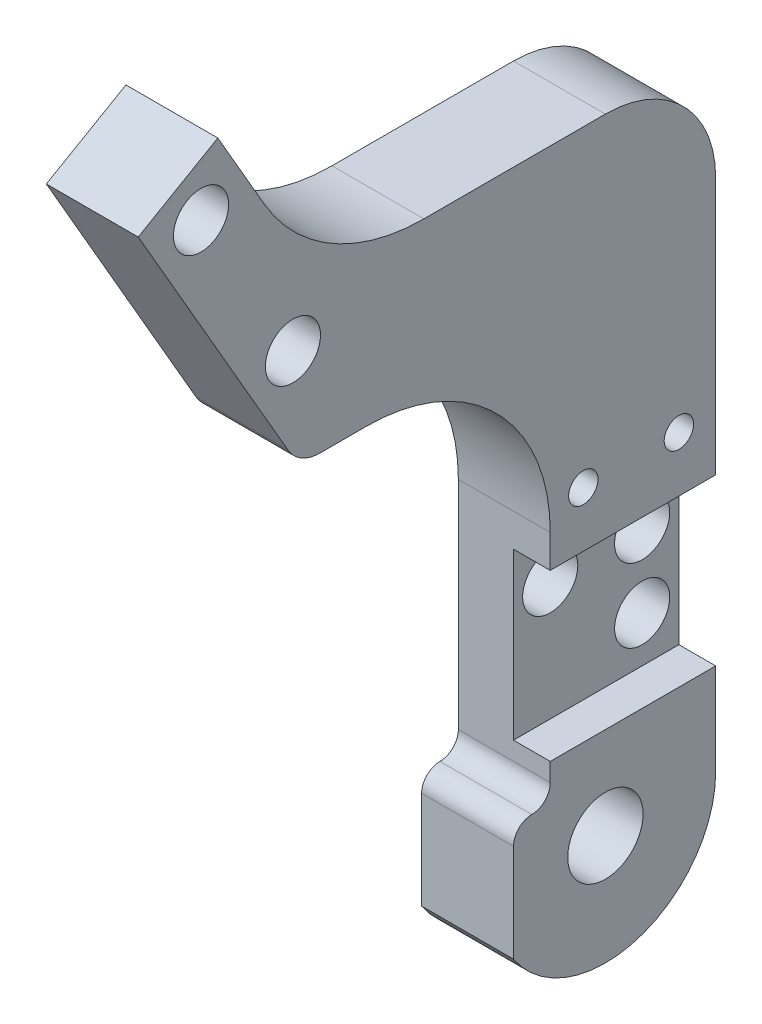
ISO-10303-21;
HEADER;
FILE_DESCRIPTION(('STEP AP214'),'2;1');
FILE_NAME('part.step','',(''),(''),'','','');
FILE_SCHEMA(('AUTOMOTIVE_DESIGN { 1 0 10303 214 1 1 1 1 }'));
ENDSEC;
DATA;
#1=APPLICATION_CONTEXT('core data for automotive mechanical design processes');
#2=APPLICATION_PROTOCOL_DEFINITION('international standard','automotive_design',2000,#1);
#3=PRODUCT_CONTEXT('',#1,'mechanical');
#4=PRODUCT('Part','Part','',(#3));
#5=PRODUCT_RELATED_PRODUCT_CATEGORY('part','',(#4));
#6=PRODUCT_DEFINITION_FORMATION('','',#4);
#7=PRODUCT_DEFINITION_CONTEXT('part definition',#1,'design');
#8=PRODUCT_DEFINITION('design','',#6,#7);
#9=PRODUCT_DEFINITION_SHAPE('','',#8);
#10=(LENGTH_UNIT() NAMED_UNIT(*) SI_UNIT(.MILLI.,.METRE.));
#11=(NAMED_UNIT(*) PLANE_ANGLE_UNIT() SI_UNIT($,.RADIAN.));
#12=(NAMED_UNIT(*) SI_UNIT($,.STERADIAN.) SOLID_ANGLE_UNIT());
#13=UNCERTAINTY_MEASURE_WITH_UNIT(LENGTH_MEASURE(1.E-05),#10,'distance_accuracy_value','');
#14=(GEOMETRIC_REPRESENTATION_CONTEXT(3) GLOBAL_UNCERTAINTY_ASSIGNED_CONTEXT((#13)) GLOBAL_UNIT_ASSIGNED_CONTEXT((#10,
#11,#12)) REPRESENTATION_CONTEXT('',''));
#15=CARTESIAN_POINT('',(0.,0.,0.));
#16=DIRECTION('',(0.,0.,1.));
#17=DIRECTION('',(1.,0.,0.));
#18=AXIS2_PLACEMENT_3D('',#15,#16,#17);
#19=CARTESIAN_POINT('',(0.,0.,0.));
#20=DIRECTION('',(-1.,0.,0.));
#21=DIRECTION('',(0.,0.,1.));
#22=AXIS2_PLACEMENT_3D('',#19,#20,#21);
#23=PLANE('',#22);
#24=CARTESIAN_POINT('',(0.,7.5,-4.));
#25=DIRECTION('',(1.,0.,0.));
#26=DIRECTION('',(0.,0.,-1.));
#27=AXIS2_PLACEMENT_3D('',#24,#25,#26);
#28=CIRCLE('',#27,1.5);
#29=CARTESIAN_POINT('',(0.,7.5,-5.5));
#30=VERTEX_POINT('',#29);
#31=EDGE_CURVE('E225',#30,#30,#28,.T.);
#32=ORIENTED_EDGE('',*,*,#31,.T.);
#33=EDGE_LOOP('',(#32));
#34=FACE_BOUND('',#33,.T.);
#35=CARTESIAN_POINT('',(0.,11.5,1.));
#36=DIRECTION('',(1.,0.,0.));
#37=DIRECTION('',(0.,0.,-1.));
#38=AXIS2_PLACEMENT_3D('',#35,#36,#37);
#39=CIRCLE('',#38,1.5);
#40=CARTESIAN_POINT('',(0.,11.5,-0.5));
#41=VERTEX_POINT('',#40);
#42=EDGE_CURVE('E231',#41,#41,#39,.T.);
#43=ORIENTED_EDGE('',*,*,#42,.T.);
#44=EDGE_LOOP('',(#43));
#45=FACE_BOUND('',#44,.T.);
#46=CARTESIAN_POINT('',(0.,40.,21.9999999999999));
#47=DIRECTION('',(1.,0.,0.));
#48=DIRECTION('',(0.,0.,-1.));
#49=AXIS2_PLACEMENT_3D('',#46,#47,#48);
#50=CIRCLE('',#49,1.5);
#51=CARTESIAN_POINT('',(0.,40.,20.4999999999999));
#52=VERTEX_POINT('',#51);
#53=EDGE_CURVE('E238',#52,#52,#50,.T.);
#54=ORIENTED_EDGE('',*,*,#53,.T.);
#55=EDGE_LOOP('',(#54));
#56=FACE_BOUND('',#55,.T.);
#57=DIRECTION('',(0.,-1.,0.));
#58=VECTOR('',#57,1.);
#59=CARTESIAN_POINT('',(0.,3.,5.));
#60=LINE('',#59,#58);
#61=CARTESIAN_POINT('',(0.,2.,5.));
#62=VERTEX_POINT('',#61);
#63=CARTESIAN_POINT('',(0.,-3.3166247903554,5.));
#64=VERTEX_POINT('',#63);
#65=EDGE_CURVE('E257',#62,#64,#60,.T.);
#66=ORIENTED_EDGE('',*,*,#65,.F.);
#67=CARTESIAN_POINT('',(0.,2.,4.));
#68=DIRECTION('',(-1.,0.,0.));
#69=DIRECTION('',(0.,0.,1.));
#70=AXIS2_PLACEMENT_3D('',#67,#68,#69);
#71=CIRCLE('',#70,1.);
#72=CARTESIAN_POINT('',(0.,3.,4.));
#73=VERTEX_POINT('',#72);
#74=EDGE_CURVE('E349',#62,#73,#71,.T.);
#75=ORIENTED_EDGE('',*,*,#74,.T.);
#76=CARTESIAN_POINT('',(0.,4.,4.));
#77=DIRECTION('',(-1.,0.,0.));
#78=DIRECTION('',(0.,0.,1.));
#79=AXIS2_PLACEMENT_3D('',#76,#77,#78);
#80=CIRCLE('',#79,1.);
#81=CARTESIAN_POINT('',(0.,4.,3.));
#82=VERTEX_POINT('',#81);
#83=EDGE_CURVE('E46',#73,#82,#80,.F.);
#84=ORIENTED_EDGE('',*,*,#83,.T.);
#85=DIRECTION('',(0.,-1.,0.));
#86=VECTOR('',#85,1.);
#87=CARTESIAN_POINT('',(0.,15.7901891737369,3.));
#88=LINE('',#87,#86);
#89=CARTESIAN_POINT('',(0.,15.7901891737369,3.));
#90=VERTEX_POINT('',#89);
#91=EDGE_CURVE('E307',#90,#82,#88,.T.);
#92=ORIENTED_EDGE('',*,*,#91,.F.);
#93=CARTESIAN_POINT('',(0.,15.7901891737369,13.));
#94=DIRECTION('',(-1.,0.,0.));
#95=DIRECTION('',(0.,0.,1.));
#96=AXIS2_PLACEMENT_3D('',#93,#94,#95);
#97=CIRCLE('',#96,10.);
#98=CARTESIAN_POINT('',(0.,25.7901891737369,13.));
#99=VERTEX_POINT('',#98);
#100=EDGE_CURVE('E305',#99,#90,#97,.T.);
#101=ORIENTED_EDGE('',*,*,#100,.F.);
#102=DIRECTION('',(0.,0.,-1.));
#103=VECTOR('',#102,1.);
#104=CARTESIAN_POINT('',(0.,25.7901891737369,15.5280127018921));
#105=LINE('',#104,#103);
#106=CARTESIAN_POINT('',(0.,25.7901891737369,15.5280127018921));
#107=VERTEX_POINT('',#106);
#108=EDGE_CURVE('E303',#107,#99,#105,.T.);
#109=ORIENTED_EDGE('',*,*,#108,.F.);
#110=CARTESIAN_POINT('',(0.,27.7901891737369,15.5280127018921));
#111=DIRECTION('',(1.,0.,0.));
#112=DIRECTION('',(0.,0.,-1.));
#113=AXIS2_PLACEMENT_3D('',#110,#111,#112);
#114=CIRCLE('',#113,2.00000000000001);
#115=CARTESIAN_POINT('',(0.,26.7901891737369,17.260063509461));
#116=VERTEX_POINT('',#115);
#117=EDGE_CURVE('E301',#116,#107,#114,.T.);
#118=ORIENTED_EDGE('',*,*,#117,.F.);
#119=DIRECTION('',(0.,-0.866025403784436,-0.500000000000004));
#120=VECTOR('',#119,1.);
#121=CARTESIAN_POINT('',(0.,40.9150635094611,25.415063509461));
#122=LINE('',#121,#120);
#123=CARTESIAN_POINT('',(0.,40.9150635094611,25.415063509461));
#124=VERTEX_POINT('',#123);
#125=EDGE_CURVE('E299',#124,#116,#122,.T.);
#126=ORIENTED_EDGE('',*,*,#125,.F.);
#127=DIRECTION('',(0.,-0.500000000000004,0.866025403784436));
#128=VECTOR('',#127,1.);
#129=CARTESIAN_POINT('',(0.,43.4150635094611,21.0849364905389));
#130=LINE('',#129,#128);
#131=CARTESIAN_POINT('',(0.,43.4150635094611,21.0849364905389));
#132=VERTEX_POINT('',#131);
#133=EDGE_CURVE('E297',#132,#124,#130,.T.);
#134=ORIENTED_EDGE('',*,*,#133,.F.);
#135=DIRECTION('',(0.,0.866025403784437,0.500000000000004));
#136=VECTOR('',#135,1.);
#137=CARTESIAN_POINT('',(0.,39.,18.5358983848621));
#138=LINE('',#137,#136);
#139=CARTESIAN_POINT('',(0.,39.,18.5358983848621));
#140=VERTEX_POINT('',#139);
#141=EDGE_CURVE('E295',#140,#132,#138,.T.);
#142=ORIENTED_EDGE('',*,*,#141,.F.);
#143=CARTESIAN_POINT('',(0.,44.,9.87564434701778));
#144=DIRECTION('',(-1.,0.,0.));
#145=DIRECTION('',(0.,0.,1.));
#146=AXIS2_PLACEMENT_3D('',#143,#144,#145);
#147=CIRCLE('',#146,10.);
#148=CARTESIAN_POINT('',(0.,34.,9.87564434701778));
#149=VERTEX_POINT('',#148);
#150=EDGE_CURVE('E293',#149,#140,#147,.T.);
#151=ORIENTED_EDGE('',*,*,#150,.F.);
#152=DIRECTION('',(0.,0.,1.));
#153=VECTOR('',#152,1.);
#154=CARTESIAN_POINT('',(0.,34.,0.));
#155=LINE('',#154,#153);
#156=CARTESIAN_POINT('',(0.,34.,0.));
#157=VERTEX_POINT('',#156);
#158=EDGE_CURVE('E291',#157,#149,#155,.T.);
#159=ORIENTED_EDGE('',*,*,#158,.F.);
#160=CARTESIAN_POINT('',(0.,28.,0.));
#161=DIRECTION('',(1.,0.,0.));
#162=DIRECTION('',(0.,0.,-1.));
#163=AXIS2_PLACEMENT_3D('',#160,#161,#162);
#164=CIRCLE('',#163,6.);
#165=CARTESIAN_POINT('',(0.,28.,-6.));
#166=VERTEX_POINT('',#165);
#167=EDGE_CURVE('E289',#166,#157,#164,.T.);
#168=ORIENTED_EDGE('',*,*,#167,.F.);
#169=DIRECTION('',(0.,1.,0.));
#170=VECTOR('',#169,1.);
#171=CARTESIAN_POINT('',(0.,0.,-6.));
#172=LINE('',#171,#170);
#173=CARTESIAN_POINT('',(0.,0.,-6.));
#174=VERTEX_POINT('',#173);
#175=EDGE_CURVE('E287',#174,#166,#172,.T.);
#176=ORIENTED_EDGE('',*,*,#175,.F.);
#177=CARTESIAN_POINT('',(0.,0.,0.));
#178=DIRECTION('',(1.,0.,0.));
#179=DIRECTION('',(0.,0.,1.));
#180=AXIS2_PLACEMENT_3D('',#177,#178,#179);
#181=CIRCLE('',#180,6.);
#182=EDGE_CURVE('E250',#64,#174,#181,.T.);
#183=ORIENTED_EDGE('',*,*,#182,.F.);
#184=EDGE_LOOP('',(#66,#75,#84,#92,#101,#109,#118,#126,#134,#142,#151,#159,#168,#176,#183));
#185=FACE_BOUND('',#184,.T.);
#186=CARTESIAN_POINT('',(0.,0.,0.));
#187=DIRECTION('',(1.,0.,0.));
#188=DIRECTION('',(0.,0.,-1.));
#189=AXIS2_PLACEMENT_3D('',#186,#187,#188);
#190=CIRCLE('',#189,2.05);
#191=CARTESIAN_POINT('',(0.,0.,-2.05));
#192=VERTEX_POINT('',#191);
#193=EDGE_CURVE('E244',#192,#192,#190,.T.);
#194=ORIENTED_EDGE('',*,*,#193,.T.);
#195=EDGE_LOOP('',(#194));
#196=FACE_BOUND('',#195,.T.);
#197=CARTESIAN_POINT('',(0.,31.3397459621556,16.9999999999999));
#198=DIRECTION('',(1.,0.,0.));
#199=DIRECTION('',(0.,0.,-1.));
#200=AXIS2_PLACEMENT_3D('',#197,#198,#199);
#201=CIRCLE('',#200,1.5);
#202=CARTESIAN_POINT('',(0.,31.3397459621556,15.4999999999999));
#203=VERTEX_POINT('',#202);
#204=EDGE_CURVE('E234',#203,#203,#201,.T.);
#205=ORIENTED_EDGE('',*,*,#204,.T.);
#206=EDGE_LOOP('',(#205));
#207=FACE_BOUND('',#206,.T.);
#208=CARTESIAN_POINT('',(0.,11.5,-4.));
#209=DIRECTION('',(1.,0.,0.));
#210=DIRECTION('',(0.,0.,-1.));
#211=AXIS2_PLACEMENT_3D('',#208,#209,#210);
#212=CIRCLE('',#211,1.5);
#213=CARTESIAN_POINT('',(0.,11.5,-5.5));
#214=VERTEX_POINT('',#213);
#215=EDGE_CURVE('E228',#214,#214,#212,.T.);
#216=ORIENTED_EDGE('',*,*,#215,.T.);
#217=EDGE_LOOP('',(#216));
#218=FACE_BOUND('',#217,.T.);
#219=CARTESIAN_POINT('',(0.,17.,-4.));
#220=DIRECTION('',(-1.,0.,0.));
#221=DIRECTION('',(0.,0.,1.));
#222=AXIS2_PLACEMENT_3D('',#219,#220,#221);
#223=CIRCLE('',#222,0.799999999999993);
#224=CARTESIAN_POINT('',(0.,17.,-3.20000000000001));
#225=VERTEX_POINT('',#224);
#226=EDGE_CURVE('E221',#225,#225,#223,.T.);
#227=ORIENTED_EDGE('',*,*,#226,.F.);
#228=EDGE_LOOP('',(#227));
#229=FACE_BOUND('',#228,.T.);
#230=CARTESIAN_POINT('',(0.,17.,1.2));
#231=DIRECTION('',(-1.,0.,0.));
#232=DIRECTION('',(0.,0.,1.));
#233=AXIS2_PLACEMENT_3D('',#230,#231,#232);
#234=CIRCLE('',#233,0.799999999999993);
#235=CARTESIAN_POINT('',(0.,17.,1.99999999999999));
#236=VERTEX_POINT('',#235);
#237=EDGE_CURVE('E215',#236,#236,#234,.T.);
#238=ORIENTED_EDGE('',*,*,#237,.F.);
#239=EDGE_LOOP('',(#238));
#240=FACE_BOUND('',#239,.T.);
#241=CARTESIAN_POINT('',(0.,28.,0.));
#242=DIRECTION('',(1.,0.,0.));
#243=DIRECTION('',(0.,0.,-1.));
#244=AXIS2_PLACEMENT_3D('',#241,#242,#243);
#245=CIRCLE('',#244,5.);
#246=CARTESIAN_POINT('',(0.,28.,-5.));
#247=VERTEX_POINT('',#246);
#248=EDGE_CURVE('E194',#247,#247,#245,.T.);
#249=ORIENTED_EDGE('',*,*,#248,.T.);
#250=EDGE_LOOP('',(#249));
#251=FACE_BOUND('',#250,.T.);
#252=ADVANCED_FACE('F37',(#34,#45,#56,#185,#196,#207,#218,#229,#240,#251),#23,.T.);
#253=CARTESIAN_POINT('',(5.,0.,0.));
#254=DIRECTION('',(-1.,0.,0.));
#255=DIRECTION('',(0.,0.,1.));
#256=AXIS2_PLACEMENT_3D('',#253,#254,#255);
#257=PLANE('',#256);
#258=CARTESIAN_POINT('',(5.,0.,0.));
#259=DIRECTION('',(1.,0.,0.));
#260=DIRECTION('',(0.,0.,-1.));
#261=AXIS2_PLACEMENT_3D('',#258,#259,#260);
#262=CIRCLE('',#261,2.05);
#263=CARTESIAN_POINT('',(5.,0.,-2.05));
#264=VERTEX_POINT('',#263);
#265=EDGE_CURVE('E247',#264,#264,#262,.T.);
#266=ORIENTED_EDGE('',*,*,#265,.F.);
#267=EDGE_LOOP('',(#266));
#268=FACE_BOUND('',#267,.T.);
#269=DIRECTION('',(0.,0.,1.));
#270=VECTOR('',#269,1.);
#271=CARTESIAN_POINT('',(5.,5.,-6.));
#272=LINE('',#271,#270);
#273=CARTESIAN_POINT('',(5.,5.,-6.));
#274=VERTEX_POINT('',#273);
#275=CARTESIAN_POINT('',(5.,5.,3.));
#276=VERTEX_POINT('',#275);
#277=EDGE_CURVE('E181',#274,#276,#272,.T.);
#278=ORIENTED_EDGE('',*,*,#277,.T.);
#279=DIRECTION('',(0.,-1.,0.));
#280=VECTOR('',#279,1.);
#281=CARTESIAN_POINT('',(5.,15.7901891737369,3.));
#282=LINE('',#281,#280);
#283=CARTESIAN_POINT('',(5.,4.,3.));
#284=VERTEX_POINT('',#283);
#285=EDGE_CURVE('E278',#276,#284,#282,.T.);
#286=ORIENTED_EDGE('',*,*,#285,.T.);
#287=CARTESIAN_POINT('',(5.,4.,4.));
#288=DIRECTION('',(-1.,0.,0.));
#289=DIRECTION('',(0.,0.,1.));
#290=AXIS2_PLACEMENT_3D('',#287,#288,#289);
#291=CIRCLE('',#290,1.);
#292=CARTESIAN_POINT('',(5.,3.,4.));
#293=VERTEX_POINT('',#292);
#294=EDGE_CURVE('E11',#284,#293,#291,.T.);
#295=ORIENTED_EDGE('',*,*,#294,.T.);
#296=CARTESIAN_POINT('',(5.,2.,4.));
#297=DIRECTION('',(-1.,0.,0.));
#298=DIRECTION('',(0.,0.,1.));
#299=AXIS2_PLACEMENT_3D('',#296,#297,#298);
#300=CIRCLE('',#299,1.);
#301=CARTESIAN_POINT('',(5.,2.,5.));
#302=VERTEX_POINT('',#301);
#303=EDGE_CURVE('E351',#293,#302,#300,.F.);
#304=ORIENTED_EDGE('',*,*,#303,.T.);
#305=DIRECTION('',(0.,-1.,0.));
#306=VECTOR('',#305,1.);
#307=CARTESIAN_POINT('',(5.,3.,5.));
#308=LINE('',#307,#306);
#309=CARTESIAN_POINT('',(5.,-3.3166247903554,5.));
#310=VERTEX_POINT('',#309);
#311=EDGE_CURVE('E282',#302,#310,#308,.T.);
#312=ORIENTED_EDGE('',*,*,#311,.T.);
#313=CARTESIAN_POINT('',(5.,0.,0.));
#314=DIRECTION('',(1.,0.,0.));
#315=DIRECTION('',(0.,0.,1.));
#316=AXIS2_PLACEMENT_3D('',#313,#314,#315);
#317=CIRCLE('',#316,6.);
#318=CARTESIAN_POINT('',(5.,0.,-6.));
#319=VERTEX_POINT('',#318);
#320=EDGE_CURVE('E253',#310,#319,#317,.T.);
#321=ORIENTED_EDGE('',*,*,#320,.T.);
#322=DIRECTION('',(0.,1.,0.));
#323=VECTOR('',#322,1.);
#324=CARTESIAN_POINT('',(5.,0.,-6.));
#325=LINE('',#324,#323);
#326=EDGE_CURVE('E258',#319,#274,#325,.T.);
#327=ORIENTED_EDGE('',*,*,#326,.T.);
#328=EDGE_LOOP('',(#278,#286,#295,#304,#312,#321,#327));
#329=FACE_BOUND('',#328,.T.);
#330=ADVANCED_FACE('F427',(#268,#329),#257,.F.);
#331=CARTESIAN_POINT('',(5.,17.,1.2));
#332=DIRECTION('',(1.,0.,0.));
#333=DIRECTION('',(0.,0.,-1.));
#334=AXIS2_PLACEMENT_3D('',#331,#332,#333);
#335=CIRCLE('',#334,0.799999999999988);
#336=CARTESIAN_POINT('',(5.,17.,0.400000000000011));
#337=VERTEX_POINT('',#336);
#338=EDGE_CURVE('E212',#337,#337,#335,.T.);
#339=ORIENTED_EDGE('',*,*,#338,.F.);
#340=EDGE_LOOP('',(#339));
#341=FACE_BOUND('',#340,.T.);
#342=CARTESIAN_POINT('',(5.,40.,21.9999999999999));
#343=DIRECTION('',(1.,0.,0.));
#344=DIRECTION('',(0.,0.,-1.));
#345=AXIS2_PLACEMENT_3D('',#342,#343,#344);
#346=CIRCLE('',#345,1.5);
#347=CARTESIAN_POINT('',(5.,40.,20.4999999999999));
#348=VERTEX_POINT('',#347);
#349=EDGE_CURVE('E241',#348,#348,#346,.T.);
#350=ORIENTED_EDGE('',*,*,#349,.F.);
#351=EDGE_LOOP('',(#350));
#352=FACE_BOUND('',#351,.T.);
#353=CARTESIAN_POINT('',(5.,31.3397459621556,16.9999999999999));
#354=DIRECTION('',(1.,0.,0.));
#355=DIRECTION('',(0.,0.,-1.));
#356=AXIS2_PLACEMENT_3D('',#353,#354,#355);
#357=CIRCLE('',#356,1.5);
#358=CARTESIAN_POINT('',(5.,31.3397459621556,15.4999999999999));
#359=VERTEX_POINT('',#358);
#360=EDGE_CURVE('E235',#359,#359,#357,.T.);
#361=ORIENTED_EDGE('',*,*,#360,.F.);
#362=EDGE_LOOP('',(#361));
#363=FACE_BOUND('',#362,.T.);
#364=CARTESIAN_POINT('',(5.,17.,-4.));
#365=DIRECTION('',(1.,0.,0.));
#366=DIRECTION('',(0.,0.,-1.));
#367=AXIS2_PLACEMENT_3D('',#364,#365,#366);
#368=CIRCLE('',#367,0.799999999999988);
#369=CARTESIAN_POINT('',(5.,17.,-4.79999999999999));
#370=VERTEX_POINT('',#369);
#371=EDGE_CURVE('E218',#370,#370,#368,.T.);
#372=ORIENTED_EDGE('',*,*,#371,.F.);
#373=EDGE_LOOP('',(#372));
#374=FACE_BOUND('',#373,.T.);
#375=DIRECTION('',(0.,0.,-1.));
#376=VECTOR('',#375,1.);
#377=CARTESIAN_POINT('',(5.,14.,-6.));
#378=LINE('',#377,#376);
#379=CARTESIAN_POINT('',(5.,14.,3.));
#380=VERTEX_POINT('',#379);
#381=CARTESIAN_POINT('',(5.,14.,-6.));
#382=VERTEX_POINT('',#381);
#383=EDGE_CURVE('E189',#380,#382,#378,.T.);
#384=ORIENTED_EDGE('',*,*,#383,.T.);
#385=CARTESIAN_POINT('',(5.,28.,-6.));
#386=VERTEX_POINT('',#385);
#387=EDGE_CURVE('E256',#382,#386,#325,.T.);
#388=ORIENTED_EDGE('',*,*,#387,.T.);
#389=CARTESIAN_POINT('',(5.,28.,0.));
#390=DIRECTION('',(1.,0.,0.));
#391=DIRECTION('',(0.,0.,-1.));
#392=AXIS2_PLACEMENT_3D('',#389,#390,#391);
#393=CIRCLE('',#392,6.);
#394=CARTESIAN_POINT('',(5.,34.,0.));
#395=VERTEX_POINT('',#394);
#396=EDGE_CURVE('E260',#386,#395,#393,.T.);
#397=ORIENTED_EDGE('',*,*,#396,.T.);
#398=DIRECTION('',(0.,0.,1.));
#399=VECTOR('',#398,1.);
#400=CARTESIAN_POINT('',(5.,34.,0.));
#401=LINE('',#400,#399);
#402=CARTESIAN_POINT('',(5.,34.,9.87564434701778));
#403=VERTEX_POINT('',#402);
#404=EDGE_CURVE('E262',#395,#403,#401,.T.);
#405=ORIENTED_EDGE('',*,*,#404,.T.);
#406=CARTESIAN_POINT('',(5.,44.,9.87564434701778));
#407=DIRECTION('',(-1.,0.,0.));
#408=DIRECTION('',(0.,0.,1.));
#409=AXIS2_PLACEMENT_3D('',#406,#407,#408);
#410=CIRCLE('',#409,10.);
#411=CARTESIAN_POINT('',(5.,39.,18.5358983848621));
#412=VERTEX_POINT('',#411);
#413=EDGE_CURVE('E264',#403,#412,#410,.T.);
#414=ORIENTED_EDGE('',*,*,#413,.T.);
#415=DIRECTION('',(0.,0.866025403784437,0.500000000000004));
#416=VECTOR('',#415,1.);
#417=CARTESIAN_POINT('',(5.,39.,18.5358983848621));
#418=LINE('',#417,#416);
#419=CARTESIAN_POINT('',(5.,43.4150635094611,21.0849364905389));
#420=VERTEX_POINT('',#419);
#421=EDGE_CURVE('E266',#412,#420,#418,.T.);
#422=ORIENTED_EDGE('',*,*,#421,.T.);
#423=DIRECTION('',(0.,-0.500000000000004,0.866025403784436));
#424=VECTOR('',#423,1.);
#425=CARTESIAN_POINT('',(5.,43.4150635094611,21.0849364905389));
#426=LINE('',#425,#424);
#427=CARTESIAN_POINT('',(5.,40.9150635094611,25.415063509461));
#428=VERTEX_POINT('',#427);
#429=EDGE_CURVE('E268',#420,#428,#426,.T.);
#430=ORIENTED_EDGE('',*,*,#429,.T.);
#431=DIRECTION('',(0.,-0.866025403784436,-0.500000000000004));
#432=VECTOR('',#431,1.);
#433=CARTESIAN_POINT('',(5.,40.9150635094611,25.415063509461));
#434=LINE('',#433,#432);
#435=CARTESIAN_POINT('',(5.,26.7901891737369,17.260063509461));
#436=VERTEX_POINT('',#435);
#437=EDGE_CURVE('E270',#428,#436,#434,.T.);
#438=ORIENTED_EDGE('',*,*,#437,.T.);
#439=CARTESIAN_POINT('',(5.,27.7901891737369,15.5280127018921));
#440=DIRECTION('',(1.,0.,0.));
#441=DIRECTION('',(0.,0.,-1.));
#442=AXIS2_PLACEMENT_3D('',#439,#440,#441);
#443=CIRCLE('',#442,2.00000000000001);
#444=CARTESIAN_POINT('',(5.,25.7901891737369,15.5280127018921));
#445=VERTEX_POINT('',#444);
#446=EDGE_CURVE('E272',#436,#445,#443,.T.);
#447=ORIENTED_EDGE('',*,*,#446,.T.);
#448=DIRECTION('',(0.,0.,-1.));
#449=VECTOR('',#448,1.);
#450=CARTESIAN_POINT('',(5.,25.7901891737369,15.5280127018921));
#451=LINE('',#450,#449);
#452=CARTESIAN_POINT('',(5.,25.7901891737369,13.));
#453=VERTEX_POINT('',#452);
#454=EDGE_CURVE('E274',#445,#453,#451,.T.);
#455=ORIENTED_EDGE('',*,*,#454,.T.);
#456=CARTESIAN_POINT('',(5.,15.7901891737369,13.));
#457=DIRECTION('',(-1.,0.,0.));
#458=DIRECTION('',(0.,0.,1.));
#459=AXIS2_PLACEMENT_3D('',#456,#457,#458);
#460=CIRCLE('',#459,10.);
#461=CARTESIAN_POINT('',(5.,15.7901891737369,3.));
#462=VERTEX_POINT('',#461);
#463=EDGE_CURVE('E276',#453,#462,#460,.T.);
#464=ORIENTED_EDGE('',*,*,#463,.T.);
#465=EDGE_CURVE('E279',#462,#380,#282,.T.);
#466=ORIENTED_EDGE('',*,*,#465,.T.);
#467=EDGE_LOOP('',(#384,#388,#397,#405,#414,#422,#430,#438,#447,#455,#464,#466));
#468=FACE_BOUND('',#467,.T.);
#469=ADVANCED_FACE('F430',(#341,#352,#363,#374,#468),#257,.F.);
#470=CARTESIAN_POINT('',(5.,0.,-6.));
#471=DIRECTION('',(0.,0.,1.));
#472=DIRECTION('',(0.,-1.,0.));
#473=AXIS2_PLACEMENT_3D('',#470,#471,#472);
#474=PLANE('',#473);
#475=DIRECTION('',(1.,0.,0.));
#476=VECTOR('',#475,1.);
#477=CARTESIAN_POINT('',(3.,5.,-6.));
#478=LINE('',#477,#476);
#479=CARTESIAN_POINT('',(3.,5.,-6.));
#480=VERTEX_POINT('',#479);
#481=EDGE_CURVE('E178',#480,#274,#478,.T.);
#482=ORIENTED_EDGE('',*,*,#481,.T.);
#483=ORIENTED_EDGE('',*,*,#326,.F.);
#484=DIRECTION('',(-1.,0.,0.));
#485=VECTOR('',#484,1.);
#486=CARTESIAN_POINT('',(5.,0.,-6.));
#487=LINE('',#486,#485);
#488=EDGE_CURVE('E343',#319,#174,#487,.T.);
#489=ORIENTED_EDGE('',*,*,#488,.T.);
#490=ORIENTED_EDGE('',*,*,#175,.T.);
#491=DIRECTION('',(-1.,0.,0.));
#492=VECTOR('',#491,1.);
#493=CARTESIAN_POINT('',(5.,28.,-6.));
#494=LINE('',#493,#492);
#495=EDGE_CURVE('E340',#386,#166,#494,.T.);
#496=ORIENTED_EDGE('',*,*,#495,.F.);
#497=ORIENTED_EDGE('',*,*,#387,.F.);
#498=DIRECTION('',(1.,0.,0.));
#499=VECTOR('',#498,1.);
#500=CARTESIAN_POINT('',(3.,14.,-6.));
#501=LINE('',#500,#499);
#502=CARTESIAN_POINT('',(3.,14.,-6.));
#503=VERTEX_POINT('',#502);
#504=EDGE_CURVE('E188',#503,#382,#501,.T.);
#505=ORIENTED_EDGE('',*,*,#504,.F.);
#506=DIRECTION('',(0.,-1.,0.));
#507=VECTOR('',#506,1.);
#508=CARTESIAN_POINT('',(3.,5.,-6.));
#509=LINE('',#508,#507);
#510=EDGE_CURVE('E170',#503,#480,#509,.T.);
#511=ORIENTED_EDGE('',*,*,#510,.T.);
#512=EDGE_LOOP('',(#482,#483,#489,#490,#496,#497,#505,#511));
#513=FACE_BOUND('',#512,.T.);
#514=ADVANCED_FACE('F186',(#513),#474,.F.);
#515=CARTESIAN_POINT('',(5.,15.7901891737369,3.));
#516=DIRECTION('',(0.,0.,-1.));
#517=DIRECTION('',(0.,1.,0.));
#518=AXIS2_PLACEMENT_3D('',#515,#516,#517);
#519=PLANE('',#518);
#520=DIRECTION('',(1.,0.,0.));
#521=VECTOR('',#520,1.);
#522=CARTESIAN_POINT('',(3.,5.,3.));
#523=LINE('',#522,#521);
#524=CARTESIAN_POINT('',(3.,5.,3.));
#525=VERTEX_POINT('',#524);
#526=EDGE_CURVE('E184',#525,#276,#523,.T.);
#527=ORIENTED_EDGE('',*,*,#526,.F.);
#528=DIRECTION('',(0.,1.,0.));
#529=VECTOR('',#528,1.);
#530=CARTESIAN_POINT('',(3.,5.,3.));
#531=LINE('',#530,#529);
#532=CARTESIAN_POINT('',(3.,14.,3.));
#533=VERTEX_POINT('',#532);
#534=EDGE_CURVE('E173',#525,#533,#531,.T.);
#535=ORIENTED_EDGE('',*,*,#534,.T.);
#536=DIRECTION('',(1.,0.,0.));
#537=VECTOR('',#536,1.);
#538=CARTESIAN_POINT('',(3.,14.,3.));
#539=LINE('',#538,#537);
#540=EDGE_CURVE('E202',#533,#380,#539,.T.);
#541=ORIENTED_EDGE('',*,*,#540,.T.);
#542=ORIENTED_EDGE('',*,*,#465,.F.);
#543=DIRECTION('',(-1.,0.,0.));
#544=VECTOR('',#543,1.);
#545=CARTESIAN_POINT('',(5.,15.7901891737369,3.));
#546=LINE('',#545,#544);
#547=EDGE_CURVE('E313',#462,#90,#546,.T.);
#548=ORIENTED_EDGE('',*,*,#547,.T.);
#549=ORIENTED_EDGE('',*,*,#91,.T.);
#550=DIRECTION('',(-1.,0.,0.));
#551=VECTOR('',#550,1.);
#552=CARTESIAN_POINT('',(5.,4.,3.));
#553=LINE('',#552,#551);
#554=EDGE_CURVE('E353',#82,#284,#553,.F.);
#555=ORIENTED_EDGE('',*,*,#554,.T.);
#556=ORIENTED_EDGE('',*,*,#285,.F.);
#557=EDGE_LOOP('',(#527,#535,#541,#542,#548,#549,#555,#556));
#558=FACE_BOUND('',#557,.T.);
#559=ADVANCED_FACE('F370',(#558),#519,.F.);
#560=CARTESIAN_POINT('',(5.,11.5,1.));
#561=DIRECTION('',(-1.,0.,0.));
#562=DIRECTION('',(0.,0.,1.));
#563=AXIS2_PLACEMENT_3D('',#560,#561,#562);
#564=CYLINDRICAL_SURFACE('',#563,1.5);
#565=ORIENTED_EDGE('',*,*,#42,.F.);
#566=EDGE_LOOP('',(#565));
#567=FACE_BOUND('',#566,.T.);
#568=CARTESIAN_POINT('',(3.,11.5,1.));
#569=DIRECTION('',(1.,0.,0.));
#570=DIRECTION('',(0.,0.,-1.));
#571=AXIS2_PLACEMENT_3D('',#568,#569,#570);
#572=CIRCLE('',#571,1.5);
#573=CARTESIAN_POINT('',(3.,11.5,-0.5));
#574=VERTEX_POINT('',#573);
#575=EDGE_CURVE('E209',#574,#574,#572,.T.);
#576=ORIENTED_EDGE('',*,*,#575,.T.);
#577=EDGE_LOOP('',(#576));
#578=FACE_BOUND('',#577,.T.);
#579=ADVANCED_FACE('F459',(#567,#578),#564,.F.);
#580=CARTESIAN_POINT('',(5.,11.5,-4.));
#581=DIRECTION('',(-1.,0.,0.));
#582=DIRECTION('',(0.,0.,1.));
#583=AXIS2_PLACEMENT_3D('',#580,#581,#582);
#584=CYLINDRICAL_SURFACE('',#583,1.5);
#585=ORIENTED_EDGE('',*,*,#215,.F.);
#586=EDGE_LOOP('',(#585));
#587=FACE_BOUND('',#586,.T.);
#588=CARTESIAN_POINT('',(3.,11.5,-4.));
#589=DIRECTION('',(1.,0.,0.));
#590=DIRECTION('',(0.,0.,-1.));
#591=AXIS2_PLACEMENT_3D('',#588,#589,#590);
#592=CIRCLE('',#591,1.5);
#593=CARTESIAN_POINT('',(3.,11.5,-5.5));
#594=VERTEX_POINT('',#593);
#595=EDGE_CURVE('E206',#594,#594,#592,.T.);
#596=ORIENTED_EDGE('',*,*,#595,.T.);
#597=EDGE_LOOP('',(#596));
#598=FACE_BOUND('',#597,.T.);
#599=ADVANCED_FACE('F572',(#587,#598),#584,.F.);
#600=CARTESIAN_POINT('',(5.,7.5,-4.));
#601=DIRECTION('',(-1.,0.,0.));
#602=DIRECTION('',(0.,0.,1.));
#603=AXIS2_PLACEMENT_3D('',#600,#601,#602);
#604=CYLINDRICAL_SURFACE('',#603,1.5);
#605=ORIENTED_EDGE('',*,*,#31,.F.);
#606=EDGE_LOOP('',(#605));
#607=FACE_BOUND('',#606,.T.);
#608=CARTESIAN_POINT('',(3.,7.5,-4.));
#609=DIRECTION('',(1.,0.,0.));
#610=DIRECTION('',(0.,0.,-1.));
#611=AXIS2_PLACEMENT_3D('',#608,#609,#610);
#612=CIRCLE('',#611,1.5);
#613=CARTESIAN_POINT('',(3.,7.5,-5.5));
#614=VERTEX_POINT('',#613);
#615=EDGE_CURVE('E41',#614,#614,#612,.T.);
#616=ORIENTED_EDGE('',*,*,#615,.T.);
#617=EDGE_LOOP('',(#616));
#618=FACE_BOUND('',#617,.T.);
#619=ADVANCED_FACE('F481',(#607,#618),#604,.F.);
#620=CARTESIAN_POINT('',(5.,0.,0.));
#621=DIRECTION('',(-1.,0.,0.));
#622=DIRECTION('',(0.,0.,1.));
#623=AXIS2_PLACEMENT_3D('',#620,#621,#622);
#624=CYLINDRICAL_SURFACE('',#623,6.);
#625=ORIENTED_EDGE('',*,*,#182,.T.);
#626=ORIENTED_EDGE('',*,*,#488,.F.);
#627=ORIENTED_EDGE('',*,*,#320,.F.);
#628=DIRECTION('',(-1.,0.,0.));
#629=VECTOR('',#628,1.);
#630=CARTESIAN_POINT('',(5.,-3.3166247903554,5.));
#631=LINE('',#630,#629);
#632=EDGE_CURVE('E284',#310,#64,#631,.T.);
#633=ORIENTED_EDGE('',*,*,#632,.T.);
#634=EDGE_LOOP('',(#625,#626,#627,#633));
#635=FACE_BOUND('',#634,.T.);
#636=ADVANCED_FACE('F421',(#635),#624,.T.);
#637=CARTESIAN_POINT('',(5.,28.,0.));
#638=DIRECTION('',(-1.,0.,0.));
#639=DIRECTION('',(0.,0.,1.));
#640=AXIS2_PLACEMENT_3D('',#637,#638,#639);
#641=CYLINDRICAL_SURFACE('',#640,6.);
#642=ORIENTED_EDGE('',*,*,#167,.T.);
#643=DIRECTION('',(-1.,0.,0.));
#644=VECTOR('',#643,1.);
#645=CARTESIAN_POINT('',(5.,34.,0.));
#646=LINE('',#645,#644);
#647=EDGE_CURVE('E337',#395,#157,#646,.T.);
#648=ORIENTED_EDGE('',*,*,#647,.F.);
#649=ORIENTED_EDGE('',*,*,#396,.F.);
#650=ORIENTED_EDGE('',*,*,#495,.T.);
#651=EDGE_LOOP('',(#642,#648,#649,#650));
#652=FACE_BOUND('',#651,.T.);
#653=ADVANCED_FACE('F416',(#652),#641,.T.);
#654=CARTESIAN_POINT('',(5.,34.,0.));
#655=DIRECTION('',(0.,-1.,0.));
#656=DIRECTION('',(0.,0.,-1.));
#657=AXIS2_PLACEMENT_3D('',#654,#655,#656);
#658=PLANE('',#657);
#659=ORIENTED_EDGE('',*,*,#158,.T.);
#660=DIRECTION('',(-1.,0.,0.));
#661=VECTOR('',#660,1.);
#662=CARTESIAN_POINT('',(5.,34.,9.87564434701778));
#663=LINE('',#662,#661);
#664=EDGE_CURVE('E334',#403,#149,#663,.T.);
#665=ORIENTED_EDGE('',*,*,#664,.F.);
#666=ORIENTED_EDGE('',*,*,#404,.F.);
#667=ORIENTED_EDGE('',*,*,#647,.T.);
#668=EDGE_LOOP('',(#659,#665,#666,#667));
#669=FACE_BOUND('',#668,.T.);
#670=ADVANCED_FACE('F411',(#669),#658,.F.);
#671=CARTESIAN_POINT('',(5.,44.,9.87564434701778));
#672=DIRECTION('',(-1.,0.,0.));
#673=DIRECTION('',(0.,0.,1.));
#674=AXIS2_PLACEMENT_3D('',#671,#672,#673);
#675=CYLINDRICAL_SURFACE('',#674,10.);
#676=ORIENTED_EDGE('',*,*,#150,.T.);
#677=DIRECTION('',(-1.,0.,0.));
#678=VECTOR('',#677,1.);
#679=CARTESIAN_POINT('',(5.,39.,18.5358983848621));
#680=LINE('',#679,#678);
#681=EDGE_CURVE('E331',#412,#140,#680,.T.);
#682=ORIENTED_EDGE('',*,*,#681,.F.);
#683=ORIENTED_EDGE('',*,*,#413,.F.);
#684=ORIENTED_EDGE('',*,*,#664,.T.);
#685=EDGE_LOOP('',(#676,#682,#683,#684));
#686=FACE_BOUND('',#685,.T.);
#687=ADVANCED_FACE('F406',(#686),#675,.F.);
#688=CARTESIAN_POINT('',(5.,39.,18.5358983848621));
#689=DIRECTION('',(0.,-0.500000000000004,0.866025403784437));
#690=DIRECTION('',(0.,-0.866025403784437,-0.500000000000004));
#691=AXIS2_PLACEMENT_3D('',#688,#689,#690);
#692=PLANE('',#691);
#693=ORIENTED_EDGE('',*,*,#141,.T.);
#694=DIRECTION('',(-1.,0.,0.));
#695=VECTOR('',#694,1.);
#696=CARTESIAN_POINT('',(5.,43.4150635094611,21.0849364905389));
#697=LINE('',#696,#695);
#698=EDGE_CURVE('E328',#420,#132,#697,.T.);
#699=ORIENTED_EDGE('',*,*,#698,.F.);
#700=ORIENTED_EDGE('',*,*,#421,.F.);
#701=ORIENTED_EDGE('',*,*,#681,.T.);
#702=EDGE_LOOP('',(#693,#699,#700,#701));
#703=FACE_BOUND('',#702,.T.);
#704=ADVANCED_FACE('F402',(#703),#692,.F.);
#705=CARTESIAN_POINT('',(5.,43.4150635094611,21.0849364905389));
#706=DIRECTION('',(0.,-0.866025403784436,-0.500000000000004));
#707=DIRECTION('',(0.,0.500000000000004,-0.866025403784436));
#708=AXIS2_PLACEMENT_3D('',#705,#706,#707);
#709=PLANE('',#708);
#710=ORIENTED_EDGE('',*,*,#133,.T.);
#711=DIRECTION('',(-1.,0.,0.));
#712=VECTOR('',#711,1.);
#713=CARTESIAN_POINT('',(5.,40.9150635094611,25.415063509461));
#714=LINE('',#713,#712);
#715=EDGE_CURVE('E325',#428,#124,#714,.T.);
#716=ORIENTED_EDGE('',*,*,#715,.F.);
#717=ORIENTED_EDGE('',*,*,#429,.F.);
#718=ORIENTED_EDGE('',*,*,#698,.T.);
#719=EDGE_LOOP('',(#710,#716,#717,#718));
#720=FACE_BOUND('',#719,.T.);
#721=ADVANCED_FACE('F397',(#720),#709,.F.);
#722=CARTESIAN_POINT('',(5.,40.9150635094611,25.415063509461));
#723=DIRECTION('',(0.,0.500000000000004,-0.866025403784436));
#724=DIRECTION('',(0.,0.866025403784436,0.500000000000004));
#725=AXIS2_PLACEMENT_3D('',#722,#723,#724);
#726=PLANE('',#725);
#727=ORIENTED_EDGE('',*,*,#125,.T.);
#728=DIRECTION('',(-1.,0.,0.));
#729=VECTOR('',#728,1.);
#730=CARTESIAN_POINT('',(5.,26.7901891737369,17.260063509461));
#731=LINE('',#730,#729);
#732=EDGE_CURVE('E322',#436,#116,#731,.T.);
#733=ORIENTED_EDGE('',*,*,#732,.F.);
#734=ORIENTED_EDGE('',*,*,#437,.F.);
#735=ORIENTED_EDGE('',*,*,#715,.T.);
#736=EDGE_LOOP('',(#727,#733,#734,#735));
#737=FACE_BOUND('',#736,.T.);
#738=ADVANCED_FACE('F391',(#737),#726,.F.);
#739=CARTESIAN_POINT('',(5.,27.7901891737369,15.5280127018921));
#740=DIRECTION('',(-1.,0.,0.));
#741=DIRECTION('',(0.,0.,1.));
#742=AXIS2_PLACEMENT_3D('',#739,#740,#741);
#743=CYLINDRICAL_SURFACE('',#742,2.00000000000001);
#744=ORIENTED_EDGE('',*,*,#117,.T.);
#745=DIRECTION('',(-1.,0.,0.));
#746=VECTOR('',#745,1.);
#747=CARTESIAN_POINT('',(5.,25.7901891737369,15.5280127018921));
#748=LINE('',#747,#746);
#749=EDGE_CURVE('E319',#445,#107,#748,.T.);
#750=ORIENTED_EDGE('',*,*,#749,.F.);
#751=ORIENTED_EDGE('',*,*,#446,.F.);
#752=ORIENTED_EDGE('',*,*,#732,.T.);
#753=EDGE_LOOP('',(#744,#750,#751,#752));
#754=FACE_BOUND('',#753,.T.);
#755=ADVANCED_FACE('F387',(#754),#743,.T.);
#756=CARTESIAN_POINT('',(5.,25.7901891737369,15.5280127018921));
#757=DIRECTION('',(0.,1.,0.));
#758=DIRECTION('',(0.,0.,1.));
#759=AXIS2_PLACEMENT_3D('',#756,#757,#758);
#760=PLANE('',#759);
#761=ORIENTED_EDGE('',*,*,#108,.T.);
#762=DIRECTION('',(-1.,0.,0.));
#763=VECTOR('',#762,1.);
#764=CARTESIAN_POINT('',(5.,25.7901891737369,13.));
#765=LINE('',#764,#763);
#766=EDGE_CURVE('E316',#453,#99,#765,.T.);
#767=ORIENTED_EDGE('',*,*,#766,.F.);
#768=ORIENTED_EDGE('',*,*,#454,.F.);
#769=ORIENTED_EDGE('',*,*,#749,.T.);
#770=EDGE_LOOP('',(#761,#767,#768,#769));
#771=FACE_BOUND('',#770,.T.);
#772=ADVANCED_FACE('F382',(#771),#760,.F.);
#773=CARTESIAN_POINT('',(5.,15.7901891737369,13.));
#774=DIRECTION('',(-1.,0.,0.));
#775=DIRECTION('',(0.,0.,1.));
#776=AXIS2_PLACEMENT_3D('',#773,#774,#775);
#777=CYLINDRICAL_SURFACE('',#776,10.);
#778=ORIENTED_EDGE('',*,*,#100,.T.);
#779=ORIENTED_EDGE('',*,*,#547,.F.);
#780=ORIENTED_EDGE('',*,*,#463,.F.);
#781=ORIENTED_EDGE('',*,*,#766,.T.);
#782=EDGE_LOOP('',(#778,#779,#780,#781));
#783=FACE_BOUND('',#782,.T.);
#784=ADVANCED_FACE('F376',(#783),#777,.F.);
#785=CARTESIAN_POINT('',(5.,3.,5.));
#786=DIRECTION('',(0.,0.,-1.));
#787=DIRECTION('',(0.,1.,0.));
#788=AXIS2_PLACEMENT_3D('',#785,#786,#787);
#789=PLANE('',#788);
#790=ORIENTED_EDGE('',*,*,#311,.F.);
#791=DIRECTION('',(-1.,0.,0.));
#792=VECTOR('',#791,1.);
#793=CARTESIAN_POINT('',(5.,2.,5.));
#794=LINE('',#793,#792);
#795=EDGE_CURVE('E346',#302,#62,#794,.T.);
#796=ORIENTED_EDGE('',*,*,#795,.T.);
#797=ORIENTED_EDGE('',*,*,#65,.T.);
#798=ORIENTED_EDGE('',*,*,#632,.F.);
#799=EDGE_LOOP('',(#790,#796,#797,#798));
#800=FACE_BOUND('',#799,.T.);
#801=ADVANCED_FACE('F426',(#800),#789,.F.);
#802=CARTESIAN_POINT('',(5.,0.,0.));
#803=DIRECTION('',(-1.,0.,0.));
#804=DIRECTION('',(0.,0.,1.));
#805=AXIS2_PLACEMENT_3D('',#802,#803,#804);
#806=CYLINDRICAL_SURFACE('',#805,2.05);
#807=ORIENTED_EDGE('',*,*,#265,.T.);
#808=EDGE_LOOP('',(#807));
#809=FACE_BOUND('',#808,.T.);
#810=ORIENTED_EDGE('',*,*,#193,.F.);
#811=EDGE_LOOP('',(#810));
#812=FACE_BOUND('',#811,.T.);
#813=ADVANCED_FACE('F456',(#809,#812),#806,.F.);
#814=CARTESIAN_POINT('',(5.,40.,21.9999999999999));
#815=DIRECTION('',(-1.,0.,0.));
#816=DIRECTION('',(0.,0.,1.));
#817=AXIS2_PLACEMENT_3D('',#814,#815,#816);
#818=CYLINDRICAL_SURFACE('',#817,1.5);
#819=ORIENTED_EDGE('',*,*,#349,.T.);
#820=EDGE_LOOP('',(#819));
#821=FACE_BOUND('',#820,.T.);
#822=ORIENTED_EDGE('',*,*,#53,.F.);
#823=EDGE_LOOP('',(#822));
#824=FACE_BOUND('',#823,.T.);
#825=ADVANCED_FACE('F494',(#821,#824),#818,.F.);
#826=CARTESIAN_POINT('',(5.,31.3397459621556,16.9999999999999));
#827=DIRECTION('',(-1.,0.,0.));
#828=DIRECTION('',(0.,0.,1.));
#829=AXIS2_PLACEMENT_3D('',#826,#827,#828);
#830=CYLINDRICAL_SURFACE('',#829,1.5);
#831=ORIENTED_EDGE('',*,*,#360,.T.);
#832=EDGE_LOOP('',(#831));
#833=FACE_BOUND('',#832,.T.);
#834=ORIENTED_EDGE('',*,*,#204,.F.);
#835=EDGE_LOOP('',(#834));
#836=FACE_BOUND('',#835,.T.);
#837=ADVANCED_FACE('F490',(#833,#836),#830,.F.);
#838=CARTESIAN_POINT('',(5.,4.,4.));
#839=DIRECTION('',(1.,0.,0.));
#840=DIRECTION('',(0.,0.,-1.));
#841=AXIS2_PLACEMENT_3D('',#838,#839,#840);
#842=CYLINDRICAL_SURFACE('',#841,1.);
#843=DIRECTION('',(-1.,0.,0.));
#844=VECTOR('',#843,1.);
#845=CARTESIAN_POINT('',(0.,3.,4.));
#846=LINE('',#845,#844);
#847=EDGE_CURVE('E224',#293,#73,#846,.T.);
#848=ORIENTED_EDGE('',*,*,#847,.F.);
#849=ORIENTED_EDGE('',*,*,#294,.F.);
#850=ORIENTED_EDGE('',*,*,#554,.F.);
#851=ORIENTED_EDGE('',*,*,#83,.F.);
#852=EDGE_LOOP('',(#848,#849,#850,#851));
#853=FACE_BOUND('',#852,.T.);
#854=ADVANCED_FACE('F39',(#853),#842,.F.);
#855=CARTESIAN_POINT('',(5.,2.,4.));
#856=DIRECTION('',(-1.,0.,0.));
#857=DIRECTION('',(0.,0.,1.));
#858=AXIS2_PLACEMENT_3D('',#855,#856,#857);
#859=CYLINDRICAL_SURFACE('',#858,1.);
#860=ORIENTED_EDGE('',*,*,#303,.F.);
#861=ORIENTED_EDGE('',*,*,#847,.T.);
#862=ORIENTED_EDGE('',*,*,#74,.F.);
#863=ORIENTED_EDGE('',*,*,#795,.F.);
#864=EDGE_LOOP('',(#860,#861,#862,#863));
#865=FACE_BOUND('',#864,.T.);
#866=ADVANCED_FACE('F359',(#865),#859,.T.);
#867=CARTESIAN_POINT('',(5.,17.,-4.));
#868=DIRECTION('',(1.,0.,0.));
#869=DIRECTION('',(0.,0.,-1.));
#870=AXIS2_PLACEMENT_3D('',#867,#868,#869);
#871=CYLINDRICAL_SURFACE('',#870,0.799999999999993);
#872=ORIENTED_EDGE('',*,*,#371,.T.);
#873=EDGE_LOOP('',(#872));
#874=FACE_BOUND('',#873,.T.);
#875=ORIENTED_EDGE('',*,*,#226,.T.);
#876=EDGE_LOOP('',(#875));
#877=FACE_BOUND('',#876,.T.);
#878=ADVANCED_FACE('F483',(#874,#877),#871,.F.);
#879=CARTESIAN_POINT('',(5.,17.,1.2));
#880=DIRECTION('',(1.,0.,0.));
#881=DIRECTION('',(0.,0.,-1.));
#882=AXIS2_PLACEMENT_3D('',#879,#880,#881);
#883=CYLINDRICAL_SURFACE('',#882,0.799999999999993);
#884=ORIENTED_EDGE('',*,*,#338,.T.);
#885=EDGE_LOOP('',(#884));
#886=FACE_BOUND('',#885,.T.);
#887=ORIENTED_EDGE('',*,*,#237,.T.);
#888=EDGE_LOOP('',(#887));
#889=FACE_BOUND('',#888,.T.);
#890=ADVANCED_FACE('F441',(#886,#889),#883,.F.);
#891=CARTESIAN_POINT('',(3.,5.,-6.));
#892=DIRECTION('',(0.,1.,0.));
#893=DIRECTION('',(0.,0.,1.));
#894=AXIS2_PLACEMENT_3D('',#891,#892,#893);
#895=PLANE('',#894);
#896=ORIENTED_EDGE('',*,*,#277,.F.);
#897=ORIENTED_EDGE('',*,*,#481,.F.);
#898=DIRECTION('',(0.,0.,1.));
#899=VECTOR('',#898,1.);
#900=CARTESIAN_POINT('',(3.,5.,-6.));
#901=LINE('',#900,#899);
#902=EDGE_CURVE('E166',#480,#525,#901,.T.);
#903=ORIENTED_EDGE('',*,*,#902,.T.);
#904=ORIENTED_EDGE('',*,*,#526,.T.);
#905=EDGE_LOOP('',(#896,#897,#903,#904));
#906=FACE_BOUND('',#905,.T.);
#907=ADVANCED_FACE('F179',(#906),#895,.T.);
#908=CARTESIAN_POINT('',(3.,14.,-6.));
#909=DIRECTION('',(0.,-1.,0.));
#910=DIRECTION('',(0.,0.,-1.));
#911=AXIS2_PLACEMENT_3D('',#908,#909,#910);
#912=PLANE('',#911);
#913=ORIENTED_EDGE('',*,*,#383,.F.);
#914=ORIENTED_EDGE('',*,*,#540,.F.);
#915=DIRECTION('',(0.,0.,-1.));
#916=VECTOR('',#915,1.);
#917=CARTESIAN_POINT('',(3.,14.,-6.));
#918=LINE('',#917,#916);
#919=EDGE_CURVE('E54',#533,#503,#918,.T.);
#920=ORIENTED_EDGE('',*,*,#919,.T.);
#921=ORIENTED_EDGE('',*,*,#504,.T.);
#922=EDGE_LOOP('',(#913,#914,#920,#921));
#923=FACE_BOUND('',#922,.T.);
#924=ADVANCED_FACE('F431',(#923),#912,.T.);
#925=CARTESIAN_POINT('',(3.,0.,0.));
#926=DIRECTION('',(1.,0.,0.));
#927=DIRECTION('',(0.,0.,-1.));
#928=AXIS2_PLACEMENT_3D('',#925,#926,#927);
#929=PLANE('',#928);
#930=ORIENTED_EDGE('',*,*,#575,.F.);
#931=EDGE_LOOP('',(#930));
#932=FACE_BOUND('',#931,.T.);
#933=ORIENTED_EDGE('',*,*,#595,.F.);
#934=EDGE_LOOP('',(#933));
#935=FACE_BOUND('',#934,.T.);
#936=ORIENTED_EDGE('',*,*,#615,.F.);
#937=EDGE_LOOP('',(#936));
#938=FACE_BOUND('',#937,.T.);
#939=ORIENTED_EDGE('',*,*,#510,.F.);
#940=ORIENTED_EDGE('',*,*,#919,.F.);
#941=ORIENTED_EDGE('',*,*,#534,.F.);
#942=ORIENTED_EDGE('',*,*,#902,.F.);
#943=EDGE_LOOP('',(#939,#940,#941,#942));
#944=FACE_BOUND('',#943,.T.);
#945=ADVANCED_FACE('F168',(#932,#935,#938,#944),#929,.T.);
#946=CARTESIAN_POINT('',(3.5,28.,0.));
#947=DIRECTION('',(-1.,0.,0.));
#948=DIRECTION('',(0.,0.,1.));
#949=AXIS2_PLACEMENT_3D('',#946,#947,#948);
#950=CYLINDRICAL_SURFACE('',#949,5.);
#951=CARTESIAN_POINT('',(3.5,28.,0.));
#952=DIRECTION('',(1.,0.,0.));
#953=DIRECTION('',(0.,0.,-1.));
#954=AXIS2_PLACEMENT_3D('',#951,#952,#953);
#955=CIRCLE('',#954,5.);
#956=CARTESIAN_POINT('',(3.5,28.,-5.));
#957=VERTEX_POINT('',#956);
#958=EDGE_CURVE('E199',#957,#957,#955,.T.);
#959=ORIENTED_EDGE('',*,*,#958,.T.);
#960=EDGE_LOOP('',(#959));
#961=FACE_BOUND('',#960,.T.);
#962=ORIENTED_EDGE('',*,*,#248,.F.);
#963=EDGE_LOOP('',(#962));
#964=FACE_BOUND('',#963,.T.);
#965=ADVANCED_FACE('F438',(#961,#964),#950,.F.);
#966=CARTESIAN_POINT('',(3.5,28.,0.));
#967=DIRECTION('',(1.,0.,0.));
#968=DIRECTION('',(0.,0.,-1.));
#969=AXIS2_PLACEMENT_3D('',#966,#967,#968);
#970=PLANE('',#969);
#971=ORIENTED_EDGE('',*,*,#958,.F.);
#972=EDGE_LOOP('',(#971));
#973=FACE_BOUND('',#972,.T.);
#974=ADVANCED_FACE('F528',(#973),#970,.F.);
#975=CLOSED_SHELL('',(#252,#330,#469,#514,#559,#579,#599,#619,#636,#653,#670,#687,#704,#721,
#738,#755,#772,#784,#801,#813,#825,#837,#854,#866,#878,#890,#907,#924,#945,#965,#974));
#976=MANIFOLD_SOLID_BREP('B2',#975);
#977=ADVANCED_BREP_SHAPE_REPRESENTATION('',(#18,#976),#14);
#978=SHAPE_DEFINITION_REPRESENTATION(#9,#977);
ENDSEC;
END-ISO-10303-21;
